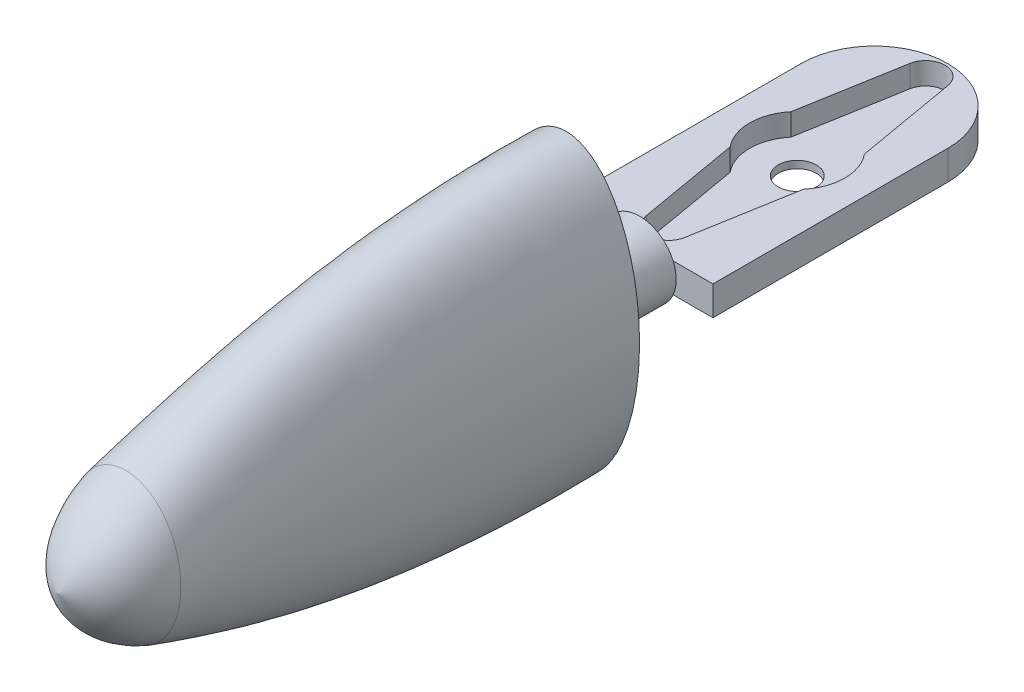
ISO-10303-21;
HEADER;
FILE_DESCRIPTION(('STEP AP214'),'2;1');
FILE_NAME('part.step','',(''),(''),'','','');
FILE_SCHEMA(('AUTOMOTIVE_DESIGN { 1 0 10303 214 1 1 1 1 }'));
ENDSEC;
DATA;
#1=APPLICATION_CONTEXT('core data for automotive mechanical design processes');
#2=APPLICATION_PROTOCOL_DEFINITION('international standard','automotive_design',2000,#1);
#3=PRODUCT_CONTEXT('',#1,'mechanical');
#4=PRODUCT('Part','Part','',(#3));
#5=PRODUCT_RELATED_PRODUCT_CATEGORY('part','',(#4));
#6=PRODUCT_DEFINITION_FORMATION('','',#4);
#7=PRODUCT_DEFINITION_CONTEXT('part definition',#1,'design');
#8=PRODUCT_DEFINITION('design','',#6,#7);
#9=PRODUCT_DEFINITION_SHAPE('','',#8);
#10=(LENGTH_UNIT() NAMED_UNIT(*) SI_UNIT(.MILLI.,.METRE.));
#11=(NAMED_UNIT(*) PLANE_ANGLE_UNIT() SI_UNIT($,.RADIAN.));
#12=(NAMED_UNIT(*) SI_UNIT($,.STERADIAN.) SOLID_ANGLE_UNIT());
#13=UNCERTAINTY_MEASURE_WITH_UNIT(LENGTH_MEASURE(1.E-05),#10,'distance_accuracy_value','');
#14=(GEOMETRIC_REPRESENTATION_CONTEXT(3) GLOBAL_UNCERTAINTY_ASSIGNED_CONTEXT((#13)) GLOBAL_UNIT_ASSIGNED_CONTEXT((#10,
#11,#12)) REPRESENTATION_CONTEXT('',''));
#15=CARTESIAN_POINT('',(0.,0.,0.));
#16=DIRECTION('',(0.,0.,1.));
#17=DIRECTION('',(1.,0.,0.));
#18=AXIS2_PLACEMENT_3D('',#15,#16,#17);
#19=CARTESIAN_POINT('',(0.,0.,-10.));
#20=DIRECTION('',(0.,0.,1.));
#21=DIRECTION('',(1.,0.,0.));
#22=AXIS2_PLACEMENT_3D('',#19,#20,#21);
#23=PLANE('',#22);
#24=DIRECTION('',(1.,0.,0.));
#25=VECTOR('',#24,1.);
#26=CARTESIAN_POINT('',(-10.,2.,-10.));
#27=LINE('',#26,#25);
#28=CARTESIAN_POINT('',(-4.58257569495584,2.,-10.));
#29=VERTEX_POINT('',#28);
#30=CARTESIAN_POINT('',(4.58257569495584,2.,-10.));
#31=VERTEX_POINT('',#30);
#32=EDGE_CURVE('E13',#29,#31,#27,.T.);
#33=ORIENTED_EDGE('',*,*,#32,.F.);
#34=CARTESIAN_POINT('',(0.,0.,-10.));
#35=DIRECTION('',(0.,0.,1.));
#36=DIRECTION('',(1.,0.,0.));
#37=AXIS2_PLACEMENT_3D('',#34,#35,#36);
#38=CIRCLE('',#37,5.);
#39=EDGE_CURVE('E477',#31,#29,#38,.T.);
#40=ORIENTED_EDGE('',*,*,#39,.F.);
#41=EDGE_LOOP('',(#33,#40));
#42=FACE_BOUND('',#41,.T.);
#43=ADVANCED_FACE('F262',(#42),#23,.F.);
#44=CARTESIAN_POINT('',(0.,0.,0.));
#45=DIRECTION('',(0.,0.,1.));
#46=DIRECTION('',(1.,0.,0.));
#47=AXIS2_PLACEMENT_3D('',#44,#45,#46);
#48=PLANE('',#47);
#49=CARTESIAN_POINT('',(0.,0.,0.));
#50=DIRECTION('',(0.,0.,1.));
#51=DIRECTION('',(1.,0.,0.));
#52=AXIS2_PLACEMENT_3D('',#49,#50,#51);
#53=CIRCLE('',#52,5.);
#54=CARTESIAN_POINT('',(5.,0.,0.));
#55=VERTEX_POINT('',#54);
#56=EDGE_CURVE('E269',#55,#55,#53,.T.);
#57=ORIENTED_EDGE('',*,*,#56,.T.);
#58=EDGE_LOOP('',(#57));
#59=FACE_BOUND('',#58,.T.);
#60=CARTESIAN_POINT('',(0.,0.,0.));
#61=DIRECTION('',(0.,0.,1.));
#62=DIRECTION('',(0.,1.,0.));
#63=AXIS2_PLACEMENT_3D('',#60,#61,#62);
#64=ELLIPSE('',#63,20.,10.);
#65=CARTESIAN_POINT('',(0.,20.,0.));
#66=VERTEX_POINT('',#65);
#67=EDGE_CURVE('E521',#66,#66,#64,.T.);
#68=ORIENTED_EDGE('',*,*,#67,.F.);
#69=EDGE_LOOP('',(#68));
#70=FACE_BOUND('',#69,.T.);
#71=ADVANCED_FACE('F505',(#59,#70),#48,.F.);
#72=CARTESIAN_POINT('',(0.,20.,0.));
#73=CARTESIAN_POINT('',(0.,20.9628748140619,20.7365674719028));
#74=CARTESIAN_POINT('',(0.,17.6295414807285,40.7365674719028));
#75=CARTESIAN_POINT('',(0.,10.,60.));
#76=CARTESIAN_POINT('',(-0.504606679227005,20.,0.));
#77=CARTESIAN_POINT('',(-0.432339748701736,20.9628748140619,20.7365674719028));
#78=CARTESIAN_POINT('',(-0.360072818176467,17.6295414807285,40.7365674719028));
#79=CARTESIAN_POINT('',(-0.287805887651198,10.,60.));
#80=CARTESIAN_POINT('',(-1.51211904377364,19.8450877064211,0.));
#81=CARTESIAN_POINT('',(-1.29583545278006,20.8278466898814,20.7365685548776));
#82=CARTESIAN_POINT('',(-1.07955186178649,17.531169399717,40.7365685546572));
#83=CARTESIAN_POINT('',(-0.86326827079291,9.95508353640808,60.));
#84=CARTESIAN_POINT('',(-3.36263948367983,18.9889580661463,0.));
#85=CARTESIAN_POINT('',(-2.90451014233172,20.0738398375189,20.7365747819824));
#86=CARTESIAN_POINT('',(-2.44638080098361,16.9757236094466,40.7365747804952));
#87=CARTESIAN_POINT('',(-1.9882514596355,9.69479636017136,60.));
#88=CARTESIAN_POINT('',(-5.22983208209301,17.2419801562347,0.));
#89=CARTESIAN_POINT('',(-4.58599471189225,18.469218030265,20.7365896728852));
#90=CARTESIAN_POINT('',(-3.9421573416915,15.7440711691936,40.7365896683686));
#91=CARTESIAN_POINT('',(-3.29831997149075,9.06710743286652,60.));
#92=CARTESIAN_POINT('',(-6.87803539166683,14.6892476927781,0.));
#93=CARTESIAN_POINT('',(-6.129196416073,15.9679155311144,20.7366172887413));
#94=CARTESIAN_POINT('',(-5.38035744047917,13.7218814154945,40.7366172786067));
#95=CARTESIAN_POINT('',(-4.63151846488533,7.95241956801191,60.0000000000001));
#96=CARTESIAN_POINT('',(-8.09791435234904,11.90933926868,0.));
#97=CARTESIAN_POINT('',(-7.29961037705591,13.1060359157074,20.736653026908));
#98=CARTESIAN_POINT('',(-6.50130640176279,11.3315024432022,40.7366530095028));
#99=CARTESIAN_POINT('',(-5.70300242646966,6.58792718910769,59.9999999999999));
#100=CARTESIAN_POINT('',(-8.97784471190876,9.00882481720827,0.));
#101=CARTESIAN_POINT('',(-8.15788934674504,10.0083980990816,20.7366952629234));
#102=CARTESIAN_POINT('',(-7.33793398158133,8.6908443384683,40.7366952369258));
#103=CARTESIAN_POINT('',(-6.51797861641761,5.05943219204327,60.0000000000001));
#104=CARTESIAN_POINT('',(-9.57634173999302,6.03754847208418,0.));
#105=CARTESIAN_POINT('',(-8.74689809764436,6.75239167506185,20.736742372325));
#106=CARTESIAN_POINT('',(-7.9174544552957,5.87968434456575,40.7367423367435));
#107=CARTESIAN_POINT('',(-7.08801081294704,3.42390010816371,60.));
#108=CARTESIAN_POINT('',(-9.92378968821849,3.02768347198876,0.));
#109=CARTESIAN_POINT('',(-9.09116418417545,3.39993803388239,20.7367927306508));
#110=CARTESIAN_POINT('',(-8.25853868013241,2.96453419262637,40.7367926848246));
#111=CARTESIAN_POINT('',(-7.42591317608937,1.72723364812232,59.9999999999999));
#112=CARTESIAN_POINT('',(-10.0381170539815,0.,0.));
#113=CARTESIAN_POINT('',(-9.20435533575895,0.00024468785131507,20.7368447134389));
#114=CARTESIAN_POINT('',(-8.37059361753635,-0.00211908646730605,40.7368446570373));
#115=CARTESIAN_POINT('',(-7.53683189931375,0.,59.9999999999999));
#116=CARTESIAN_POINT('',(-9.9237896882185,-3.02768347198876,0.));
#117=CARTESIAN_POINT('',(-9.09116418417546,-3.39944865817978,20.7368966962269));
#118=CARTESIAN_POINT('',(-8.25853868013242,-2.96877236556099,40.7368966292501));
#119=CARTESIAN_POINT('',(-7.42591317608937,-1.72723364812231,60.));
#120=CARTESIAN_POINT('',(-9.57634173999301,-6.03754847208416,0.));
#121=CARTESIAN_POINT('',(-8.74689809764436,-6.75190229935922,20.7369470545528));
#122=CARTESIAN_POINT('',(-7.9174544552957,-5.88392251750035,40.7369469773312));
#123=CARTESIAN_POINT('',(-7.08801081294705,-3.4239001081637,60.0000000000001));
#124=CARTESIAN_POINT('',(-8.97784471190877,-9.00882481720829,0.));
#125=CARTESIAN_POINT('',(-8.15788934674505,-10.007908723379,20.7369941639544));
#126=CARTESIAN_POINT('',(-7.33793398158132,-8.69508251140291,40.7369940771489));
#127=CARTESIAN_POINT('',(-6.5179786164176,-5.05943219204327,59.9999999999999));
#128=CARTESIAN_POINT('',(-8.09791435234902,-11.90933926868,0.));
#129=CARTESIAN_POINT('',(-7.2996103770559,-13.1055465400048,20.7370363999697));
#130=CARTESIAN_POINT('',(-6.50130640176279,-11.3357406161368,40.7370363045718));
#131=CARTESIAN_POINT('',(-5.70300242646968,-6.58792718910769,60.));
#132=CARTESIAN_POINT('',(-6.87803539166684,-14.6892476927781,0.));
#133=CARTESIAN_POINT('',(-6.129196416073,-15.9674261554118,20.7370721381364));
#134=CARTESIAN_POINT('',(-5.38035744047916,-13.7261195884291,40.737072035468));
#135=CARTESIAN_POINT('',(-4.63151846488532,-7.95241956801191,59.9999999999999));
#136=CARTESIAN_POINT('',(-5.229832082093,-17.2419801562347,0.));
#137=CARTESIAN_POINT('',(-4.58599471189225,-18.4687286545624,20.7370997539926));
#138=CARTESIAN_POINT('',(-3.94215734169151,-15.7483093421282,40.7370996457061));
#139=CARTESIAN_POINT('',(-3.29831997149077,-9.0671074328665,60.0000000000001));
#140=CARTESIAN_POINT('',(-3.36263948367983,-18.9889580661462,0.));
#141=CARTESIAN_POINT('',(-2.90451014233172,-20.0733504618162,20.7371146448954));
#142=CARTESIAN_POINT('',(-2.44638080098361,-16.9799617823811,40.7371145335795));
#143=CARTESIAN_POINT('',(-1.9882514596355,-9.69479636017136,60.));
#144=CARTESIAN_POINT('',(-1.51211904377365,-19.8450877064211,0.));
#145=CARTESIAN_POINT('',(-1.29583545278007,-20.8273573141788,20.7371208720002));
#146=CARTESIAN_POINT('',(-1.07955186178649,-17.5354075726516,40.7371207594175));
#147=CARTESIAN_POINT('',(-0.86326827079291,-9.95508353640808,60.));
#148=CARTESIAN_POINT('',(-0.504606679227006,-20.,0.));
#149=CARTESIAN_POINT('',(-0.432339748701736,-20.9623854383592,20.737121954975));
#150=CARTESIAN_POINT('',(-0.360072818176467,-17.6337796536631,40.7371218421719));
#151=CARTESIAN_POINT('',(-0.287805887651199,-10.,60.));
#152=CARTESIAN_POINT('',(0.504606679227004,-20.,0.));
#153=CARTESIAN_POINT('',(0.432339748701736,-20.9623854383592,20.737121954975));
#154=CARTESIAN_POINT('',(0.360072818176467,-17.6337796536631,40.7371218421719));
#155=CARTESIAN_POINT('',(0.287805887651198,-10.,60.));
#156=CARTESIAN_POINT('',(1.51211904377363,-19.845087706421,0.));
#157=CARTESIAN_POINT('',(1.29583545278006,-20.8273573141788,20.7371208720002));
#158=CARTESIAN_POINT('',(1.07955186178648,-17.5354075726516,40.7371207594175));
#159=CARTESIAN_POINT('',(0.863268270792907,-9.95508353640808,60.));
#160=CARTESIAN_POINT('',(3.36263948367984,-18.9889580661463,0.));
#161=CARTESIAN_POINT('',(2.90451014233173,-20.0733504618163,20.7371146448954));
#162=CARTESIAN_POINT('',(2.44638080098361,-16.9799617823812,40.7371145335795));
#163=CARTESIAN_POINT('',(1.98825145963549,-9.69479636017136,60.));
#164=CARTESIAN_POINT('',(5.22983208209299,-17.2419801562346,0.));
#165=CARTESIAN_POINT('',(4.58599471189224,-18.4687286545624,20.7370997539926));
#166=CARTESIAN_POINT('',(3.94215734169149,-15.7483093421282,40.7370996457061));
#167=CARTESIAN_POINT('',(3.29831997149075,-9.06710743286651,60.0000000000001));
#168=CARTESIAN_POINT('',(6.87803539166685,-14.6892476927781,0.));
#169=CARTESIAN_POINT('',(6.12919641607301,-15.9674261554118,20.7370721381365));
#170=CARTESIAN_POINT('',(5.38035744047917,-13.7261195884291,40.7370720354681));
#171=CARTESIAN_POINT('',(4.63151846488532,-7.95241956801192,60.));
#172=CARTESIAN_POINT('',(8.097914352349,-11.9093392686799,0.));
#173=CARTESIAN_POINT('',(7.29961037705589,-13.1055465400048,20.7370363999697));
#174=CARTESIAN_POINT('',(6.50130640176278,-11.3357406161368,40.7370363045718));
#175=CARTESIAN_POINT('',(5.70300242646967,-6.58792718910769,60.));
#176=CARTESIAN_POINT('',(8.97784471190879,-9.00882481720831,0.));
#177=CARTESIAN_POINT('',(8.15788934674506,-10.007908723379,20.7369941639545));
#178=CARTESIAN_POINT('',(7.33793398158133,-8.6950825114029,40.736994077149));
#179=CARTESIAN_POINT('',(6.5179786164176,-5.05943219204327,60.0000000000001));
#180=CARTESIAN_POINT('',(9.57634173999297,-6.03754847208416,0.));
#181=CARTESIAN_POINT('',(8.74689809764433,-6.75190229935923,20.7369470545528));
#182=CARTESIAN_POINT('',(7.91745445529568,-5.88392251750034,40.7369469773311));
#183=CARTESIAN_POINT('',(7.08801081294704,-3.42390010816371,59.9999999999999));
#184=CARTESIAN_POINT('',(9.92378968821853,-3.02768347198879,0.));
#185=CARTESIAN_POINT('',(9.09116418417547,-3.39944865817981,20.7368966962269));
#186=CARTESIAN_POINT('',(8.25853868013242,-2.96877236556098,40.7368966292501));
#187=CARTESIAN_POINT('',(7.42591317608936,-1.72723364812232,60.));
#188=CARTESIAN_POINT('',(10.0381170539815,0.,0.));
#189=CARTESIAN_POINT('',(9.20435533575893,0.000244687851300687,20.7368447134389));
#190=CARTESIAN_POINT('',(8.37059361753634,-0.00211908646729286,40.7368446570374));
#191=CARTESIAN_POINT('',(7.53683189931376,0.,60.0000000000001));
#192=CARTESIAN_POINT('',(9.92378968821852,3.02768347198875,0.));
#193=CARTESIAN_POINT('',(9.09116418417547,3.39993803388239,20.7367927306509));
#194=CARTESIAN_POINT('',(8.25853868013242,2.96453419262639,40.7367926848246));
#195=CARTESIAN_POINT('',(7.42591317608937,1.72723364812231,60.));
#196=CARTESIAN_POINT('',(9.57634173999299,6.03754847208416,0.));
#197=CARTESIAN_POINT('',(8.74689809764434,6.75239167506184,20.7367423723249));
#198=CARTESIAN_POINT('',(7.91745445529569,5.87968434456575,40.7367423367435));
#199=CARTESIAN_POINT('',(7.08801081294704,3.42390010816371,59.9999999999999));
#200=CARTESIAN_POINT('',(8.97784471190878,9.00882481720828,0.));
#201=CARTESIAN_POINT('',(8.15788934674505,10.0083980990816,20.7366952629234));
#202=CARTESIAN_POINT('',(7.33793398158133,8.6908443384683,40.7366952369258));
#203=CARTESIAN_POINT('',(6.51797861641761,5.05943219204325,60.0000000000001));
#204=CARTESIAN_POINT('',(8.09791435234902,11.90933926868,0.));
#205=CARTESIAN_POINT('',(7.29961037705591,13.1060359157075,20.736653026908));
#206=CARTESIAN_POINT('',(6.50130640176279,11.3315024432022,40.7366530095029));
#207=CARTESIAN_POINT('',(5.70300242646967,6.5879271891077,59.9999999999999));
#208=CARTESIAN_POINT('',(6.87803539166684,14.689247692778,0.));
#209=CARTESIAN_POINT('',(6.129196416073,15.9679155311144,20.7366172887413));
#210=CARTESIAN_POINT('',(5.38035744047917,13.7218814154945,40.7366172786066));
#211=CARTESIAN_POINT('',(4.63151846488533,7.95241956801187,60.));
#212=CARTESIAN_POINT('',(5.22983208209301,17.2419801562347,0.));
#213=CARTESIAN_POINT('',(4.58599471189226,18.4692180302651,20.7365896728852));
#214=CARTESIAN_POINT('',(3.94215734169151,15.7440711691936,40.7365896683687));
#215=CARTESIAN_POINT('',(3.29831997149076,9.06710743286654,60.));
#216=CARTESIAN_POINT('',(3.36263948367981,18.9889580661462,0.));
#217=CARTESIAN_POINT('',(2.90451014233171,20.0738398375189,20.7365747819824));
#218=CARTESIAN_POINT('',(2.44638080098361,16.9757236094466,40.7365747804952));
#219=CARTESIAN_POINT('',(1.98825145963551,9.69479636017135,60.));
#220=CARTESIAN_POINT('',(1.51211904377363,19.8450877064211,0.));
#221=CARTESIAN_POINT('',(1.29583545278006,20.8278466898814,20.7365685548775));
#222=CARTESIAN_POINT('',(1.07955186178648,17.531169399717,40.7365685546572));
#223=CARTESIAN_POINT('',(0.863268270792912,9.95508353640808,60.));
#224=CARTESIAN_POINT('',(0.504606679227005,20.,0.));
#225=CARTESIAN_POINT('',(0.432339748701736,20.9628748140619,20.7365674719028));
#226=CARTESIAN_POINT('',(0.360072818176467,17.6295414807285,40.7365674719028));
#227=CARTESIAN_POINT('',(0.287805887651198,10.,60.));
#228=CARTESIAN_POINT('',(0.,20.,0.));
#229=CARTESIAN_POINT('',(0.,20.9628748140619,20.7365674719028));
#230=CARTESIAN_POINT('',(0.,17.6295414807285,40.7365674719028));
#231=CARTESIAN_POINT('',(0.,10.,60.));
#232=B_SPLINE_SURFACE_WITH_KNOTS('',3,3,((#72,#73,#74,#75),(#76,#77,#78,#79),(#80,#81,#82,#83),
(#84,#85,#86,#87),(#88,#89,#90,#91),(#92,#93,#94,#95),(#96,#97,#98,#99),(#100,#101,#102,#103),
(#104,#105,#106,#107),(#108,#109,#110,#111),(#112,#113,#114,#115),(#116,#117,#118,#119),(#120,
#121,#122,#123),(#124,#125,#126,#127),(#128,#129,#130,#131),(#132,#133,#134,#135),(#136,#137,
#138,#139),(#140,#141,#142,#143),(#144,#145,#146,#147),(#148,#149,#150,#151),(#152,#153,#154,
#155),(#156,#157,#158,#159),(#160,#161,#162,#163),(#164,#165,#166,#167),(#168,#169,#170,#171),
(#172,#173,#174,#175),(#176,#177,#178,#179),(#180,#181,#182,#183),(#184,#185,#186,#187),(#188,
#189,#190,#191),(#192,#193,#194,#195),(#196,#197,#198,#199),(#200,#201,#202,#203),(#204,#205,
#206,#207),(#208,#209,#210,#211),(#212,#213,#214,#215),(#216,#217,#218,#219),(#220,#221,#222,
#223),(#224,#225,#226,#227),(#228,#229,#230,#231)),.UNSPECIFIED.,.T.,.F.,.F.,(4,1,1,1,1,1,1,1,1,
1,1,1,1,1,1,1,1,1,2,1,1,1,1,1,1,1,1,1,1,1,1,1,1,1,1,1,4),(4,4),(0.,0.015625,0.03125,0.0625,
0.09375,0.125,0.15625,0.1875,0.21875,0.25,0.28125,0.3125,0.34375,0.375,0.40625,0.4375,0.46875,
0.484375,0.5,0.515625,0.53125,0.5625,0.59375,0.625,0.65625,0.6875,0.71875,0.75,0.78125,0.8125,
0.84375,0.875,0.90625,0.9375,0.96875,0.984375,1.),(0.,1.),.UNSPECIFIED.);
#233=CARTESIAN_POINT('',(0.,0.,60.));
#234=DIRECTION('',(0.,0.,1.));
#235=DIRECTION('',(0.,1.,0.));
#236=AXIS2_PLACEMENT_3D('',#233,#234,#235);
#237=ELLIPSE('',#236,10.,7.5);
#238=CARTESIAN_POINT('',(0.,10.,60.));
#239=VERTEX_POINT('',#238);
#240=EDGE_CURVE('E485',#239,#239,#237,.T.);
#241=ORIENTED_EDGE('',*,*,#67,.T.);
#242=EDGE_LOOP('',(#241));
#243=FACE_BOUND('',#242,.T.);
#244=ORIENTED_EDGE('',*,*,#240,.F.);
#245=EDGE_LOOP('',(#244));
#246=FACE_BOUND('',#245,.T.);
#247=ADVANCED_FACE('F264',(#243,#246),#232,.T.);
#248=CARTESIAN_POINT('',(0.,10.0000152590616,59.9999614731579));
#249=CARTESIAN_POINT('',(-0.287803424048341,10.0000152590621,59.9999614731579));
#250=CARTESIAN_POINT('',(-0.863410087878709,9.95583806079738,59.9999616989012));
#251=CARTESIAN_POINT('',(-1.70677312786941,9.75940519727775,59.9999626442014));
#252=CARTESIAN_POINT('',(-2.5125052540897,9.44384043728572,59.9999641256418));
#253=CARTESIAN_POINT('',(-3.52032980804554,8.88137952784575,59.9999667216897));
#254=CARTESIAN_POINT('',(-4.63153206478585,7.95229875926061,59.9999709543765));
#255=CARTESIAN_POINT('',(-5.70299471729741,6.58813345922687,59.9999770494447));
#256=CARTESIAN_POINT('',(-6.51776252975134,5.05911322216334,59.999983595999));
#257=CARTESIAN_POINT('',(-7.08825990947597,3.42436248739937,59.9999900296803));
#258=CARTESIAN_POINT('',(-7.42538142170511,1.72683829704838,59.9999957861308));
#259=CARTESIAN_POINT('',(-7.53720343131966,1.77942804894839E-06,60.0000003009872));
#260=CARTESIAN_POINT('',(-7.42538182773256,-1.72683444277763,60.0000030098973));
#261=CARTESIAN_POINT('',(-7.08826154695672,-3.42435351790571,60.0000042514798));
#262=CARTESIAN_POINT('',(-6.51776543721104,-5.05910195659626,60.000004364351));
#263=CARTESIAN_POINT('',(-5.70299866760887,-6.58811961293905,60.000003687124));
#264=CARTESIAN_POINT('',(-4.63153646261046,-7.95228393543587,60.0000025584126));
#265=CARTESIAN_POINT('',(-3.52033371559342,-8.8813642154407,60.0000015237605));
#266=CARTESIAN_POINT('',(-2.51250847558941,-9.4438251370515,60.0000008089098));
#267=CARTESIAN_POINT('',(-1.70677513471405,-9.75938991922258,60.0000003715341));
#268=CARTESIAN_POINT('',(-0.863411631977673,-9.95582280064711,60.0000000752474));
#269=CARTESIAN_POINT('',(9.21327419500936E-08,-10.0220885996758,59.9999999623763));
#270=CARTESIAN_POINT('',(0.863411263446692,-9.95582280064988,60.0000000752475));
#271=CARTESIAN_POINT('',(1.70677537055961,-9.75938990592728,60.0000003715342));
#272=CARTESIAN_POINT('',(2.51250837067826,-9.44382512413137,60.0000008089099));
#273=CARTESIAN_POINT('',(3.52033377111656,-8.88136425973224,60.0000015237605));
#274=CARTESIAN_POINT('',(4.6315364367399,-7.95228384295369,60.0000025584126));
#275=CARTESIAN_POINT('',(5.70299867190342,-6.58811976750625,60.0000036871241));
#276=CARTESIAN_POINT('',(6.5177654515679,-5.05910167722607,60.000004364351));
#277=CARTESIAN_POINT('',(7.08826150963172,-3.42435401414788,60.0000042514799));
#278=CARTESIAN_POINT('',(7.42538182773985,-1.72683370569057,60.0000030098973));
#279=CARTESIAN_POINT('',(7.53720343131984,1.41092674045898E-06,60.0000003009873));
#280=CARTESIAN_POINT('',(7.42538142169712,1.72683903414345,59.9999957861308));
#281=CARTESIAN_POINT('',(7.08825994680124,3.4243619911558,59.9999900296804));
#282=CARTESIAN_POINT('',(6.51776251539432,5.05911350153438,59.9999835959991));
#283=CARTESIAN_POINT('',(5.70299471300302,6.5881333046591,59.9999770494446));
#284=CARTESIAN_POINT('',(4.63153209065633,7.95229885174312,59.9999709543766));
#285=CARTESIAN_POINT('',(3.52032975252255,8.88137948355395,59.9999667216896));
#286=CARTESIAN_POINT('',(2.51250535900069,9.44384045020598,59.9999641256419));
#287=CARTESIAN_POINT('',(1.70677289202421,9.75940521057294,59.9999626442013));
#288=CARTESIAN_POINT('',(0.863410456411341,9.95583806079459,59.9999616989013));
#289=CARTESIAN_POINT('',(0.28780342404834,10.0000152590612,59.9999614731579));
#290=CARTESIAN_POINT('',(0.,10.0000152590616,59.9999614731579));
#291=CARTESIAN_POINT('',(0.,8.00461265679434,64.8798268998124));
#292=CARTESIAN_POINT('',(-0.239844495986041,8.00461265679463,64.8798268998124));
#293=CARTESIAN_POINT('',(-0.719533399249717,7.97010534170234,64.8789348724661));
#294=CARTESIAN_POINT('',(-1.42502114744341,7.81754404755485,64.8752552632517));
#295=CARTESIAN_POINT('',(-2.10397749682092,7.57239546161922,64.8695685996863));
#296=CARTESIAN_POINT('',(-2.96174846628874,7.13456501050219,64.8597563275896));
#297=CARTESIAN_POINT('',(-3.92636985841736,6.40741839779871,64.844145920811));
#298=CARTESIAN_POINT('',(-4.88561231412082,5.3280095503153,64.8227374367754));
#299=CARTESIAN_POINT('',(-5.639104575166,4.10502234791035,64.8013290675904));
#300=CARTESIAN_POINT('',(-6.18392114989125,2.78569498036572,64.782596924007));
#301=CARTESIAN_POINT('',(-6.51616764664176,1.40702628589317,64.7692171167772));
#302=CARTESIAN_POINT('',(-6.63016477434849,1.30840135144877E-06,64.7638657615095));
#303=CARTESIAN_POINT('',(-6.51616725434082,-1.40702257953857,64.7692189349483));
#304=CARTESIAN_POINT('',(-6.1839213359567,-2.7856856626788,64.7826004494841));
#305=CARTESIAN_POINT('',(-5.63910563273601,-4.10500863966178,64.8013341563742));
#306=CARTESIAN_POINT('',(-4.88561426730983,-5.32799104221447,64.8227439020161));
#307=CARTESIAN_POINT('',(-3.92637239736226,-6.40739621185812,64.8441535328079));
#308=CARTESIAN_POINT('',(-2.9617509186739,-7.13454033479935,64.859764668091));
#309=CARTESIAN_POINT('',(-2.10397962668336,-7.57236943837021,64.8695773652904));
#310=CARTESIAN_POINT('',(-1.42502254581573,-7.81751725837538,64.8752642634761));
#311=CARTESIAN_POINT('',(-0.719534483554649,-7.97007806230867,64.8789440177478));
#312=CARTESIAN_POINT('',(5.8350736122153E-08,-8.02183885480926,64.880282108905));
#313=CARTESIAN_POINT('',(0.719534250151694,-7.97007806231043,64.8789440177478));
#314=CARTESIAN_POINT('',(1.42502269518459,-7.81751724995503,64.8752642634761));
#315=CARTESIAN_POINT('',(2.10397956023962,-7.57236943018745,64.8695773652904));
#316=CARTESIAN_POINT('',(2.96175095383855,-7.13454036285065,64.8597646680911));
#317=CARTESIAN_POINT('',(3.92637238097756,-6.40739615328607,64.8441535328079));
#318=CARTESIAN_POINT('',(4.8856142700297,-5.32799114010703,64.8227439020161));
#319=CARTESIAN_POINT('',(5.63910564182867,-4.10500846272732,64.8013341563742));
#320=CARTESIAN_POINT('',(6.1839213123175,-2.7856859769655,64.7826004494842));
#321=CARTESIAN_POINT('',(6.5161672543454,-1.40702211271676,64.7692189349483));
#322=CARTESIAN_POINT('',(6.63016477434856,1.07501718941624E-06,64.7638657615095));
#323=CARTESIAN_POINT('',(6.51616764663667,1.40702675272005,64.7692171167772));
#324=CARTESIAN_POINT('',(6.18392117353056,2.78569466607812,64.782596924007));
#325=CARTESIAN_POINT('',(5.63910456607319,4.10502252484534,64.8013290675904));
#326=CARTESIAN_POINT('',(4.88561231140102,5.32800945242238,64.8227374367753));
#327=CARTESIAN_POINT('',(3.92636987480198,6.40741845637097,64.844145920811));
#328=CARTESIAN_POINT('',(2.96174843112418,7.13456498245072,64.8597563275895));
#329=CARTESIAN_POINT('',(2.10397756326454,7.57239546980205,64.8695685996864));
#330=CARTESIAN_POINT('',(1.42502099807479,7.81754405597513,64.8752552632517));
#331=CARTESIAN_POINT('',(0.719533576666528,7.97010534170057,64.8789348724661));
#332=CARTESIAN_POINT('',(0.23984449598604,8.00461265679405,64.8798268998124));
#333=CARTESIAN_POINT('',(0.,8.00461265679434,64.8798268998124));
#334=CARTESIAN_POINT('',(0.,4.67127321983636,67.9491032710654));
#335=CARTESIAN_POINT('',(-0.147472231280877,4.67127321983653,67.9491032710654));
#336=CARTESIAN_POINT('',(-0.442416646674226,4.65115066599031,67.9482111534218));
#337=CARTESIAN_POINT('',(-0.876499701967563,4.56220197349015,67.9445311660874));
#338=CARTESIAN_POINT('',(-1.29481865965088,4.41927045409244,67.9388439099457));
#339=CARTESIAN_POINT('',(-1.82426722316895,4.16398176556881,67.9290305994299));
#340=CARTESIAN_POINT('',(-2.42176853536788,3.73992874092336,67.9134184995766));
#341=CARTESIAN_POINT('',(-3.01911711606277,3.11023507546829,67.8920075775136));
#342=CARTESIAN_POINT('',(-3.49088598684313,2.39654941674917,67.8705965897069));
#343=CARTESIAN_POINT('',(-3.8337661354016,1.62643717354596,67.8518618726511));
#344=CARTESIAN_POINT('',(-4.04388760732951,0.821535708992759,67.8384797628411));
#345=CARTESIAN_POINT('',(-4.11634707953471,7.22138445247417E-07,67.8331266016308));
#346=CARTESIAN_POINT('',(-4.04388728302095,-0.821533377675594,67.8384786915056));
#347=CARTESIAN_POINT('',(-3.83376611577527,-1.62643095038539,67.8518597094084));
#348=CARTESIAN_POINT('',(-3.49088648182588,-2.39653975974214,67.8705933711499));
#349=CARTESIAN_POINT('',(-3.01911816475015,-3.11022162445594,67.8920033876826));
#350=CARTESIAN_POINT('',(-2.42176996841928,-3.73991214785461,67.9134134699591));
#351=CARTESIAN_POINT('',(-1.82426863961957,-4.16396299368034,67.929025019103));
#352=CARTESIAN_POINT('',(-1.2948199061342,-4.41925043888818,67.9388380022426));
#353=CARTESIAN_POINT('',(-0.876500530611882,-4.56218124655249,67.9445250753786));
#354=CARTESIAN_POINT('',(-0.442417290348249,-4.65112948170805,67.9482049481649));
#355=CARTESIAN_POINT('',(3.37820050750976E-08,-4.68131314510974,67.9495430844707));
#356=CARTESIAN_POINT('',(0.442417155220223,-4.65112948170906,67.9482049481649));
#357=CARTESIAN_POINT('',(0.876500617088586,-4.56218124167755,67.9445250753786));
#358=CARTESIAN_POINT('',(1.29481986766677,-4.4192504341508,67.9388380022426));
#359=CARTESIAN_POINT('',(1.82426865997805,-4.16396300992057,67.929025019103));
#360=CARTESIAN_POINT('',(2.4217699589334,-3.73991211394448,67.9134134699591));
#361=CARTESIAN_POINT('',(3.0191181663248,-3.11022168113057,67.8920033876826));
#362=CARTESIAN_POINT('',(3.49088648709004,-2.3965396573064,67.8705933711499));
#363=CARTESIAN_POINT('',(3.8337661020894,-1.62643113234086,67.8518597094084));
#364=CARTESIAN_POINT('',(4.04388728302358,-0.821533107410339,67.8384786915056));
#365=CARTESIAN_POINT('',(4.11634707953474,5.87021298974547E-07,67.8331266016308));
#366=CARTESIAN_POINT('',(4.04388760732655,0.821535979260951,67.8384797628411));
#367=CARTESIAN_POINT('',(3.83376614908751,1.62643699158998,67.851861872651));
#368=CARTESIAN_POINT('',(3.49088598157886,2.39654951918522,67.8705965897069));
#369=CARTESIAN_POINT('',(3.01911711448814,3.11023501879344,67.8920075775136));
#370=CARTESIAN_POINT('',(2.42176854485371,3.73992877483362,67.9134184995766));
#371=CARTESIAN_POINT('',(1.82426720281052,4.16398174932849,67.9290305994298));
#372=CARTESIAN_POINT('',(1.29481869811824,4.41927045882987,67.9388439099458));
#373=CARTESIAN_POINT('',(0.876499615490989,4.56220197836505,67.9445311660873));
#374=CARTESIAN_POINT('',(0.442416741011039,4.65115066598929,67.9482111534218));
#375=CARTESIAN_POINT('',(0.147472231280877,4.67127321983619,67.9491032710654));
#376=CARTESIAN_POINT('',(0.,4.67127321983636,67.9491032710654));
#377=CARTESIAN_POINT('',(0.,0.,69.2077828815485));
#378=CARTESIAN_POINT('',(0.,0.,69.2077828815485));
#379=CARTESIAN_POINT('',(0.,0.,69.2077828815485));
#380=CARTESIAN_POINT('',(0.,0.,69.2077828815485));
#381=CARTESIAN_POINT('',(0.,0.,69.2077828815485));
#382=CARTESIAN_POINT('',(0.,0.,69.2077828815485));
#383=CARTESIAN_POINT('',(0.,0.,69.2077828815485));
#384=CARTESIAN_POINT('',(0.,0.,69.2077828815485));
#385=CARTESIAN_POINT('',(0.,0.,69.2077828815485));
#386=CARTESIAN_POINT('',(0.,0.,69.2077828815485));
#387=CARTESIAN_POINT('',(0.,0.,69.2077828815485));
#388=CARTESIAN_POINT('',(0.,0.,69.2077828815485));
#389=CARTESIAN_POINT('',(0.,0.,69.2077828815485));
#390=CARTESIAN_POINT('',(0.,0.,69.2077828815485));
#391=CARTESIAN_POINT('',(0.,0.,69.2077828815485));
#392=CARTESIAN_POINT('',(0.,0.,69.2077828815485));
#393=CARTESIAN_POINT('',(0.,0.,69.2077828815485));
#394=CARTESIAN_POINT('',(0.,0.,69.2077828815485));
#395=CARTESIAN_POINT('',(0.,0.,69.2077828815485));
#396=CARTESIAN_POINT('',(0.,0.,69.2077828815485));
#397=CARTESIAN_POINT('',(0.,0.,69.2077828815485));
#398=CARTESIAN_POINT('',(0.,0.,69.2077828815485));
#399=CARTESIAN_POINT('',(0.,0.,69.2077828815485));
#400=CARTESIAN_POINT('',(0.,0.,69.2077828815485));
#401=CARTESIAN_POINT('',(0.,0.,69.2077828815485));
#402=CARTESIAN_POINT('',(0.,0.,69.2077828815485));
#403=CARTESIAN_POINT('',(0.,0.,69.2077828815485));
#404=CARTESIAN_POINT('',(0.,0.,69.2077828815485));
#405=CARTESIAN_POINT('',(0.,0.,69.2077828815485));
#406=CARTESIAN_POINT('',(0.,0.,69.2077828815485));
#407=CARTESIAN_POINT('',(0.,0.,69.2077828815485));
#408=CARTESIAN_POINT('',(0.,0.,69.2077828815485));
#409=CARTESIAN_POINT('',(0.,0.,69.2077828815485));
#410=CARTESIAN_POINT('',(0.,0.,69.2077828815485));
#411=CARTESIAN_POINT('',(0.,0.,69.2077828815485));
#412=CARTESIAN_POINT('',(0.,0.,69.2077828815485));
#413=CARTESIAN_POINT('',(0.,0.,69.2077828815485));
#414=CARTESIAN_POINT('',(0.,0.,69.2077828815485));
#415=CARTESIAN_POINT('',(0.,0.,69.2077828815485));
#416=CARTESIAN_POINT('',(0.,0.,69.2077828815485));
#417=CARTESIAN_POINT('',(0.,0.,69.2077828815485));
#418=CARTESIAN_POINT('',(0.,0.,69.2077828815485));
#419=CARTESIAN_POINT('',(0.,0.,69.2077828815485));
#420=B_SPLINE_SURFACE_WITH_KNOTS('',3,3,((#248,#249,#250,#251,#252,#253,#254,#255,#256,#257,
#258,#259,#260,#261,#262,#263,#264,#265,#266,#267,#268,#269,#270,#271,#272,#273,#274,#275,#276,
#277,#278,#279,#280,#281,#282,#283,#284,#285,#286,#287,#288,#289,#290),(#291,#292,#293,#294,
#295,#296,#297,#298,#299,#300,#301,#302,#303,#304,#305,#306,#307,#308,#309,#310,#311,#312,#313,
#314,#315,#316,#317,#318,#319,#320,#321,#322,#323,#324,#325,#326,#327,#328,#329,#330,#331,#332,
#333),(#334,#335,#336,#337,#338,#339,#340,#341,#342,#343,#344,#345,#346,#347,#348,#349,#350,
#351,#352,#353,#354,#355,#356,#357,#358,#359,#360,#361,#362,#363,#364,#365,#366,#367,#368,#369,
#370,#371,#372,#373,#374,#375,#376),(#377,#378,#379,#380,#381,#382,#383,#384,#385,#386,#387,
#388,#389,#390,#391,#392,#393,#394,#395,#396,#397,#398,#399,#400,#401,#402,#403,#404,#405,#406,
#407,#408,#409,#410,#411,#412,#413,#414,#415,#416,#417,#418,#419)),.UNSPECIFIED.,.F.,.T.,.F.,(4,
4),(4,1,1,1,1,1,1,1,1,1,1,1,1,1,1,1,1,1,1,1,1,1,1,1,1,1,1,1,1,1,1,1,1,1,1,1,1,1,1,1,4),(0.,1.),
(0.,0.0156250212739034,0.0312500425478067,0.0468750638217101,0.0625000850956135,
0.0937501276434202,0.125000170191227,0.156250212739034,0.18750025528684,0.218750297834647,
0.250000340382454,0.281250297834647,0.312500255286841,0.343750212739034,0.375000170191227,
0.40625012764342,0.437500085095614,0.453125063821711,0.468750042547807,0.484375021273904,
0.500000000000001,0.515624978726097,0.531249957452194,0.546874936178291,0.562499914904387,
0.59374987235658,0.624999829808774,0.656249787260967,0.68749974471316,0.718749702165354,
0.749999659617547,0.781249702165353,0.81249974471316,0.843749787260967,0.874999829808773,
0.90624987235658,0.937499914904387,0.95312493617829,0.968749957452193,0.984374978726097,1.),.UNSPECIFIED.);
#421=ORIENTED_EDGE('',*,*,#240,.T.);
#422=EDGE_LOOP('',(#421));
#423=FACE_BOUND('',#422,.T.);
#424=CARTESIAN_POINT('',(0.,0.,69.2077828815485));
#425=VERTEX_POINT('',#424);
#426=VERTEX_LOOP('',#425);
#427=FACE_BOUND('',#426,.T.);
#428=ADVANCED_FACE('F492',(#423,#427),#420,.F.);
#429=CARTESIAN_POINT('',(0.,0.,-10.));
#430=DIRECTION('',(0.,0.,1.));
#431=DIRECTION('',(1.,0.,0.));
#432=AXIS2_PLACEMENT_3D('',#429,#430,#431);
#433=CYLINDRICAL_SURFACE('',#432,5.);
#434=ORIENTED_EDGE('',*,*,#39,.T.);
#435=CARTESIAN_POINT('',(-4.58257569495584,-2.,-10.));
#436=VERTEX_POINT('',#435);
#437=EDGE_CURVE('E480',#29,#436,#38,.T.);
#438=ORIENTED_EDGE('',*,*,#437,.T.);
#439=CARTESIAN_POINT('',(4.58257569495584,-2.,-10.));
#440=VERTEX_POINT('',#439);
#441=EDGE_CURVE('E561',#436,#440,#38,.T.);
#442=ORIENTED_EDGE('',*,*,#441,.T.);
#443=EDGE_CURVE('E470',#440,#31,#38,.T.);
#444=ORIENTED_EDGE('',*,*,#443,.T.);
#445=EDGE_LOOP('',(#434,#438,#442,#444));
#446=FACE_BOUND('',#445,.T.);
#447=ORIENTED_EDGE('',*,*,#56,.F.);
#448=EDGE_LOOP('',(#447));
#449=FACE_BOUND('',#448,.T.);
#450=ADVANCED_FACE('F503',(#446,#449),#433,.T.);
#451=ORIENTED_EDGE('',*,*,#441,.F.);
#452=DIRECTION('',(1.,0.,0.));
#453=VECTOR('',#452,1.);
#454=CARTESIAN_POINT('',(-10.,-2.,-10.));
#455=LINE('',#454,#453);
#456=EDGE_CURVE('E274',#436,#440,#455,.T.);
#457=ORIENTED_EDGE('',*,*,#456,.T.);
#458=EDGE_LOOP('',(#451,#457));
#459=FACE_BOUND('',#458,.T.);
#460=ADVANCED_FACE('F563',(#459),#23,.F.);
#461=CARTESIAN_POINT('',(-10.,-2.,-10.));
#462=DIRECTION('',(0.,0.,1.));
#463=DIRECTION('',(1.,0.,0.));
#464=AXIS2_PLACEMENT_3D('',#461,#462,#463);
#465=PLANE('',#464);
#466=ORIENTED_EDGE('',*,*,#437,.F.);
#467=CARTESIAN_POINT('',(-10.,2.,-10.));
#468=VERTEX_POINT('',#467);
#469=EDGE_CURVE('E276',#468,#29,#27,.T.);
#470=ORIENTED_EDGE('',*,*,#469,.F.);
#471=DIRECTION('',(0.,1.,0.));
#472=VECTOR('',#471,1.);
#473=CARTESIAN_POINT('',(-10.,-2.,-10.));
#474=LINE('',#473,#472);
#475=CARTESIAN_POINT('',(-10.,-2.,-10.));
#476=VERTEX_POINT('',#475);
#477=EDGE_CURVE('E468',#476,#468,#474,.T.);
#478=ORIENTED_EDGE('',*,*,#477,.F.);
#479=EDGE_CURVE('E457',#476,#436,#455,.T.);
#480=ORIENTED_EDGE('',*,*,#479,.T.);
#481=EDGE_LOOP('',(#466,#470,#478,#480));
#482=FACE_BOUND('',#481,.T.);
#483=ADVANCED_FACE('F568',(#482),#465,.T.);
#484=ORIENTED_EDGE('',*,*,#443,.F.);
#485=CARTESIAN_POINT('',(10.,-2.,-10.));
#486=VERTEX_POINT('',#485);
#487=EDGE_CURVE('E292',#440,#486,#455,.T.);
#488=ORIENTED_EDGE('',*,*,#487,.T.);
#489=DIRECTION('',(0.,1.,0.));
#490=VECTOR('',#489,1.);
#491=CARTESIAN_POINT('',(10.,-2.,-10.));
#492=LINE('',#491,#490);
#493=CARTESIAN_POINT('',(10.,2.,-10.));
#494=VERTEX_POINT('',#493);
#495=EDGE_CURVE('E467',#486,#494,#492,.T.);
#496=ORIENTED_EDGE('',*,*,#495,.T.);
#497=EDGE_CURVE('E277',#31,#494,#27,.T.);
#498=ORIENTED_EDGE('',*,*,#497,.F.);
#499=EDGE_LOOP('',(#484,#488,#496,#498));
#500=FACE_BOUND('',#499,.T.);
#501=ADVANCED_FACE('F537',(#500),#465,.T.);
#502=CARTESIAN_POINT('',(-10.,-2.,-10.));
#503=DIRECTION('',(1.,0.,0.));
#504=DIRECTION('',(0.,0.,-1.));
#505=AXIS2_PLACEMENT_3D('',#502,#503,#504);
#506=PLANE('',#505);
#507=ORIENTED_EDGE('',*,*,#477,.T.);
#508=DIRECTION('',(0.,0.,-1.));
#509=VECTOR('',#508,1.);
#510=CARTESIAN_POINT('',(-10.,2.,-10.));
#511=LINE('',#510,#509);
#512=CARTESIAN_POINT('',(-10.,2.,-42.));
#513=VERTEX_POINT('',#512);
#514=EDGE_CURVE('E454',#468,#513,#511,.T.);
#515=ORIENTED_EDGE('',*,*,#514,.T.);
#516=DIRECTION('',(0.,1.,0.));
#517=VECTOR('',#516,1.);
#518=CARTESIAN_POINT('',(-10.,-2.,-42.));
#519=LINE('',#518,#517);
#520=CARTESIAN_POINT('',(-10.,-2.,-42.));
#521=VERTEX_POINT('',#520);
#522=EDGE_CURVE('E471',#521,#513,#519,.T.);
#523=ORIENTED_EDGE('',*,*,#522,.F.);
#524=DIRECTION('',(0.,0.,-1.));
#525=VECTOR('',#524,1.);
#526=CARTESIAN_POINT('',(-10.,-2.,-10.));
#527=LINE('',#526,#525);
#528=EDGE_CURVE('E465',#476,#521,#527,.T.);
#529=ORIENTED_EDGE('',*,*,#528,.F.);
#530=EDGE_LOOP('',(#507,#515,#523,#529));
#531=FACE_BOUND('',#530,.T.);
#532=ADVANCED_FACE('F575',(#531),#506,.F.);
#533=CARTESIAN_POINT('',(0.,-2.,-42.));
#534=DIRECTION('',(0.,1.,0.));
#535=DIRECTION('',(0.,0.,1.));
#536=AXIS2_PLACEMENT_3D('',#533,#534,#535);
#537=CYLINDRICAL_SURFACE('',#536,10.);
#538=ORIENTED_EDGE('',*,*,#522,.T.);
#539=CARTESIAN_POINT('',(0.,2.,-42.));
#540=DIRECTION('',(0.,-1.,0.));
#541=DIRECTION('',(0.,0.,-1.));
#542=AXIS2_PLACEMENT_3D('',#539,#540,#541);
#543=CIRCLE('',#542,10.);
#544=CARTESIAN_POINT('',(10.,2.,-42.));
#545=VERTEX_POINT('',#544);
#546=EDGE_CURVE('E451',#513,#545,#543,.T.);
#547=ORIENTED_EDGE('',*,*,#546,.T.);
#548=DIRECTION('',(0.,1.,0.));
#549=VECTOR('',#548,1.);
#550=CARTESIAN_POINT('',(10.,-2.,-42.));
#551=LINE('',#550,#549);
#552=CARTESIAN_POINT('',(10.,-2.,-42.));
#553=VERTEX_POINT('',#552);
#554=EDGE_CURVE('E473',#553,#545,#551,.T.);
#555=ORIENTED_EDGE('',*,*,#554,.F.);
#556=CARTESIAN_POINT('',(0.,-2.,-42.));
#557=DIRECTION('',(0.,-1.,0.));
#558=DIRECTION('',(0.,0.,-1.));
#559=AXIS2_PLACEMENT_3D('',#556,#557,#558);
#560=CIRCLE('',#559,10.);
#561=EDGE_CURVE('E463',#521,#553,#560,.T.);
#562=ORIENTED_EDGE('',*,*,#561,.F.);
#563=EDGE_LOOP('',(#538,#547,#555,#562));
#564=FACE_BOUND('',#563,.T.);
#565=ADVANCED_FACE('F549',(#564),#537,.T.);
#566=CARTESIAN_POINT('',(10.,-2.,-10.));
#567=DIRECTION('',(1.,0.,0.));
#568=DIRECTION('',(0.,0.,-1.));
#569=AXIS2_PLACEMENT_3D('',#566,#567,#568);
#570=PLANE('',#569);
#571=ORIENTED_EDGE('',*,*,#554,.T.);
#572=DIRECTION('',(0.,0.,-1.));
#573=VECTOR('',#572,1.);
#574=CARTESIAN_POINT('',(10.,2.,-10.));
#575=LINE('',#574,#573);
#576=EDGE_CURVE('E448',#494,#545,#575,.T.);
#577=ORIENTED_EDGE('',*,*,#576,.F.);
#578=ORIENTED_EDGE('',*,*,#495,.F.);
#579=DIRECTION('',(0.,0.,-1.));
#580=VECTOR('',#579,1.);
#581=CARTESIAN_POINT('',(10.,-2.,-10.));
#582=LINE('',#581,#580);
#583=EDGE_CURVE('E460',#486,#553,#582,.T.);
#584=ORIENTED_EDGE('',*,*,#583,.T.);
#585=EDGE_LOOP('',(#571,#577,#578,#584));
#586=FACE_BOUND('',#585,.T.);
#587=ADVANCED_FACE('F541',(#586),#570,.T.);
#588=CARTESIAN_POINT('',(0.,-2.,-42.));
#589=DIRECTION('',(0.,-1.,0.));
#590=DIRECTION('',(0.,0.,-1.));
#591=AXIS2_PLACEMENT_3D('',#588,#589,#590);
#592=PLANE('',#591);
#593=CARTESIAN_POINT('',(0.,-2.,-31.49));
#594=DIRECTION('',(0.,1.,0.));
#595=DIRECTION('',(0.,0.,1.));
#596=AXIS2_PLACEMENT_3D('',#593,#594,#595);
#597=CIRCLE('',#596,2.6);
#598=CARTESIAN_POINT('',(0.,-2.,-28.89));
#599=VERTEX_POINT('',#598);
#600=EDGE_CURVE('E418',#599,#599,#597,.T.);
#601=ORIENTED_EDGE('',*,*,#600,.T.);
#602=EDGE_LOOP('',(#601));
#603=FACE_BOUND('',#602,.T.);
#604=ORIENTED_EDGE('',*,*,#479,.F.);
#605=ORIENTED_EDGE('',*,*,#528,.T.);
#606=ORIENTED_EDGE('',*,*,#561,.T.);
#607=ORIENTED_EDGE('',*,*,#583,.F.);
#608=ORIENTED_EDGE('',*,*,#487,.F.);
#609=ORIENTED_EDGE('',*,*,#456,.F.);
#610=EDGE_LOOP('',(#604,#605,#606,#607,#608,#609));
#611=FACE_BOUND('',#610,.T.);
#612=ADVANCED_FACE('F543',(#603,#611),#592,.T.);
#613=CARTESIAN_POINT('',(0.,2.,-42.));
#614=DIRECTION('',(0.,-1.,0.));
#615=DIRECTION('',(0.,0.,-1.));
#616=AXIS2_PLACEMENT_3D('',#613,#614,#615);
#617=PLANE('',#616);
#618=DIRECTION('',(-0.171428571428571,0.,0.98519655140381));
#619=VECTOR('',#618,1.);
#620=CARTESIAN_POINT('',(-2.6,2.,-49.4324115366413));
#621=LINE('',#620,#619);
#622=CARTESIAN_POINT('',(-2.6,2.,-49.4324115366413));
#623=VERTEX_POINT('',#622);
#624=CARTESIAN_POINT('',(-5.,2.,-35.6396598169879));
#625=VERTEX_POINT('',#624);
#626=EDGE_CURVE('E417',#623,#625,#621,.T.);
#627=ORIENTED_EDGE('',*,*,#626,.F.);
#628=CARTESIAN_POINT('',(0.,2.,-48.98));
#629=DIRECTION('',(0.,1.,0.));
#630=DIRECTION('',(0.,0.,1.));
#631=AXIS2_PLACEMENT_3D('',#628,#629,#630);
#632=CIRCLE('',#631,2.63906729707412);
#633=CARTESIAN_POINT('',(2.6,2.,-49.4324115366413));
#634=VERTEX_POINT('',#633);
#635=EDGE_CURVE('E284',#634,#623,#632,.T.);
#636=ORIENTED_EDGE('',*,*,#635,.F.);
#637=DIRECTION('',(-0.171428571428572,0.,-0.98519655140381));
#638=VECTOR('',#637,1.);
#639=CARTESIAN_POINT('',(2.6,2.,-49.4324115366413));
#640=LINE('',#639,#638);
#641=CARTESIAN_POINT('',(5.,2.,-35.6396598169879));
#642=VERTEX_POINT('',#641);
#643=EDGE_CURVE('E394',#642,#634,#640,.T.);
#644=ORIENTED_EDGE('',*,*,#643,.F.);
#645=CARTESIAN_POINT('',(0.,2.,-31.49));
#646=DIRECTION('',(0.,1.,0.));
#647=DIRECTION('',(0.,0.,1.));
#648=AXIS2_PLACEMENT_3D('',#645,#646,#647);
#649=CIRCLE('',#648,6.49766701183774);
#650=CARTESIAN_POINT('',(5.,2.,-27.3403401830121));
#651=VERTEX_POINT('',#650);
#652=EDGE_CURVE('E397',#651,#642,#649,.T.);
#653=ORIENTED_EDGE('',*,*,#652,.F.);
#654=DIRECTION('',(0.171428571428572,0.,-0.985196551403809));
#655=VECTOR('',#654,1.);
#656=CARTESIAN_POINT('',(5.,2.,-27.3403401830121));
#657=LINE('',#656,#655);
#658=CARTESIAN_POINT('',(2.6,2.,-13.5475884633587));
#659=VERTEX_POINT('',#658);
#660=EDGE_CURVE('E429',#659,#651,#657,.T.);
#661=ORIENTED_EDGE('',*,*,#660,.F.);
#662=CARTESIAN_POINT('',(0.,2.,-14.));
#663=DIRECTION('',(0.,1.,0.));
#664=DIRECTION('',(0.,0.,1.));
#665=AXIS2_PLACEMENT_3D('',#662,#663,#664);
#666=CIRCLE('',#665,2.63906729707412);
#667=CARTESIAN_POINT('',(-2.6,2.,-13.5475884633587));
#668=VERTEX_POINT('',#667);
#669=EDGE_CURVE('E426',#668,#659,#666,.T.);
#670=ORIENTED_EDGE('',*,*,#669,.F.);
#671=DIRECTION('',(0.171428571428571,0.,0.98519655140381));
#672=VECTOR('',#671,1.);
#673=CARTESIAN_POINT('',(-5.,2.,-27.3403401830121));
#674=LINE('',#673,#672);
#675=CARTESIAN_POINT('',(-5.,2.,-27.3403401830121));
#676=VERTEX_POINT('',#675);
#677=EDGE_CURVE('E423',#676,#668,#674,.T.);
#678=ORIENTED_EDGE('',*,*,#677,.F.);
#679=CARTESIAN_POINT('',(0.,2.,-31.49));
#680=DIRECTION('',(0.,1.,0.));
#681=DIRECTION('',(0.,0.,1.));
#682=AXIS2_PLACEMENT_3D('',#679,#680,#681);
#683=CIRCLE('',#682,6.49766701183774);
#684=EDGE_CURVE('E420',#625,#676,#683,.T.);
#685=ORIENTED_EDGE('',*,*,#684,.F.);
#686=EDGE_LOOP('',(#627,#636,#644,#653,#661,#670,#678,#685));
#687=FACE_BOUND('',#686,.T.);
#688=ORIENTED_EDGE('',*,*,#469,.T.);
#689=ORIENTED_EDGE('',*,*,#32,.T.);
#690=ORIENTED_EDGE('',*,*,#497,.T.);
#691=ORIENTED_EDGE('',*,*,#576,.T.);
#692=ORIENTED_EDGE('',*,*,#546,.F.);
#693=ORIENTED_EDGE('',*,*,#514,.F.);
#694=EDGE_LOOP('',(#688,#689,#690,#691,#692,#693));
#695=FACE_BOUND('',#694,.T.);
#696=ADVANCED_FACE('F552',(#687,#695),#617,.F.);
#697=CARTESIAN_POINT('',(0.,-1.,-48.98));
#698=DIRECTION('',(0.,1.,0.));
#699=DIRECTION('',(0.,0.,1.));
#700=AXIS2_PLACEMENT_3D('',#697,#698,#699);
#701=CYLINDRICAL_SURFACE('',#700,2.63906729707412);
#702=ORIENTED_EDGE('',*,*,#635,.T.);
#703=DIRECTION('',(0.,1.,0.));
#704=VECTOR('',#703,1.);
#705=CARTESIAN_POINT('',(-2.6,-1.,-49.4324115366413));
#706=LINE('',#705,#704);
#707=CARTESIAN_POINT('',(-2.6,-1.,-49.4324115366413));
#708=VERTEX_POINT('',#707);
#709=EDGE_CURVE('E371',#708,#623,#706,.T.);
#710=ORIENTED_EDGE('',*,*,#709,.F.);
#711=CARTESIAN_POINT('',(0.,-1.,-48.98));
#712=DIRECTION('',(0.,1.,0.));
#713=DIRECTION('',(0.,0.,1.));
#714=AXIS2_PLACEMENT_3D('',#711,#712,#713);
#715=CIRCLE('',#714,2.63906729707412);
#716=CARTESIAN_POINT('',(2.6,-1.,-49.4324115366413));
#717=VERTEX_POINT('',#716);
#718=EDGE_CURVE('E375',#717,#708,#715,.T.);
#719=ORIENTED_EDGE('',*,*,#718,.F.);
#720=DIRECTION('',(0.,1.,0.));
#721=VECTOR('',#720,1.);
#722=CARTESIAN_POINT('',(2.6,-1.,-49.4324115366413));
#723=LINE('',#722,#721);
#724=EDGE_CURVE('E434',#717,#634,#723,.T.);
#725=ORIENTED_EDGE('',*,*,#724,.T.);
#726=EDGE_LOOP('',(#702,#710,#719,#725));
#727=FACE_BOUND('',#726,.T.);
#728=ADVANCED_FACE('F373',(#727),#701,.F.);
#729=CARTESIAN_POINT('',(2.6,-1.,-49.4324115366413));
#730=DIRECTION('',(0.985196551403809,0.,-0.171428571428572));
#731=DIRECTION('',(-0.171428571428572,0.,-0.98519655140381));
#732=AXIS2_PLACEMENT_3D('',#729,#730,#731);
#733=PLANE('',#732);
#734=ORIENTED_EDGE('',*,*,#643,.T.);
#735=ORIENTED_EDGE('',*,*,#724,.F.);
#736=DIRECTION('',(-0.171428571428572,0.,-0.98519655140381));
#737=VECTOR('',#736,1.);
#738=CARTESIAN_POINT('',(2.6,-1.,-49.4324115366413));
#739=LINE('',#738,#737);
#740=CARTESIAN_POINT('',(5.,-1.,-35.6396598169879));
#741=VERTEX_POINT('',#740);
#742=EDGE_CURVE('E381',#741,#717,#739,.T.);
#743=ORIENTED_EDGE('',*,*,#742,.F.);
#744=DIRECTION('',(0.,1.,0.));
#745=VECTOR('',#744,1.);
#746=CARTESIAN_POINT('',(5.,-1.,-35.6396598169879));
#747=LINE('',#746,#745);
#748=EDGE_CURVE('E436',#741,#642,#747,.T.);
#749=ORIENTED_EDGE('',*,*,#748,.T.);
#750=EDGE_LOOP('',(#734,#735,#743,#749));
#751=FACE_BOUND('',#750,.T.);
#752=ADVANCED_FACE('F613',(#751),#733,.F.);
#753=CARTESIAN_POINT('',(0.,-1.,-31.49));
#754=DIRECTION('',(0.,1.,0.));
#755=DIRECTION('',(0.,0.,1.));
#756=AXIS2_PLACEMENT_3D('',#753,#754,#755);
#757=CYLINDRICAL_SURFACE('',#756,6.49766701183774);
#758=ORIENTED_EDGE('',*,*,#652,.T.);
#759=ORIENTED_EDGE('',*,*,#748,.F.);
#760=CARTESIAN_POINT('',(0.,-1.,-31.49));
#761=DIRECTION('',(0.,1.,0.));
#762=DIRECTION('',(0.,0.,1.));
#763=AXIS2_PLACEMENT_3D('',#760,#761,#762);
#764=CIRCLE('',#763,6.49766701183774);
#765=CARTESIAN_POINT('',(5.,-1.,-27.3403401830121));
#766=VERTEX_POINT('',#765);
#767=EDGE_CURVE('E413',#766,#741,#764,.T.);
#768=ORIENTED_EDGE('',*,*,#767,.F.);
#769=DIRECTION('',(0.,1.,0.));
#770=VECTOR('',#769,1.);
#771=CARTESIAN_POINT('',(5.,-1.,-27.3403401830121));
#772=LINE('',#771,#770);
#773=EDGE_CURVE('E438',#766,#651,#772,.T.);
#774=ORIENTED_EDGE('',*,*,#773,.T.);
#775=EDGE_LOOP('',(#758,#759,#768,#774));
#776=FACE_BOUND('',#775,.T.);
#777=ADVANCED_FACE('F616',(#776),#757,.F.);
#778=CARTESIAN_POINT('',(5.,-1.,-27.3403401830121));
#779=DIRECTION('',(0.98519655140381,0.,0.171428571428572));
#780=DIRECTION('',(0.171428571428572,0.,-0.98519655140381));
#781=AXIS2_PLACEMENT_3D('',#778,#779,#780);
#782=PLANE('',#781);
#783=ORIENTED_EDGE('',*,*,#660,.T.);
#784=ORIENTED_EDGE('',*,*,#773,.F.);
#785=DIRECTION('',(0.171428571428572,0.,-0.985196551403809));
#786=VECTOR('',#785,1.);
#787=CARTESIAN_POINT('',(5.,-1.,-27.3403401830121));
#788=LINE('',#787,#786);
#789=CARTESIAN_POINT('',(2.6,-1.,-13.5475884633587));
#790=VERTEX_POINT('',#789);
#791=EDGE_CURVE('E410',#790,#766,#788,.T.);
#792=ORIENTED_EDGE('',*,*,#791,.F.);
#793=DIRECTION('',(0.,1.,0.));
#794=VECTOR('',#793,1.);
#795=CARTESIAN_POINT('',(2.6,-1.,-13.5475884633587));
#796=LINE('',#795,#794);
#797=EDGE_CURVE('E440',#790,#659,#796,.T.);
#798=ORIENTED_EDGE('',*,*,#797,.T.);
#799=EDGE_LOOP('',(#783,#784,#792,#798));
#800=FACE_BOUND('',#799,.T.);
#801=ADVANCED_FACE('F620',(#800),#782,.F.);
#802=CARTESIAN_POINT('',(0.,-1.,-14.));
#803=DIRECTION('',(0.,1.,0.));
#804=DIRECTION('',(0.,0.,1.));
#805=AXIS2_PLACEMENT_3D('',#802,#803,#804);
#806=CYLINDRICAL_SURFACE('',#805,2.63906729707412);
#807=ORIENTED_EDGE('',*,*,#669,.T.);
#808=ORIENTED_EDGE('',*,*,#797,.F.);
#809=CARTESIAN_POINT('',(0.,-1.,-14.));
#810=DIRECTION('',(0.,1.,0.));
#811=DIRECTION('',(0.,0.,1.));
#812=AXIS2_PLACEMENT_3D('',#809,#810,#811);
#813=CIRCLE('',#812,2.63906729707412);
#814=CARTESIAN_POINT('',(-2.6,-1.,-13.5475884633587));
#815=VERTEX_POINT('',#814);
#816=EDGE_CURVE('E407',#815,#790,#813,.T.);
#817=ORIENTED_EDGE('',*,*,#816,.F.);
#818=DIRECTION('',(0.,1.,0.));
#819=VECTOR('',#818,1.);
#820=CARTESIAN_POINT('',(-2.6,-1.,-13.5475884633587));
#821=LINE('',#820,#819);
#822=EDGE_CURVE('E442',#815,#668,#821,.T.);
#823=ORIENTED_EDGE('',*,*,#822,.T.);
#824=EDGE_LOOP('',(#807,#808,#817,#823));
#825=FACE_BOUND('',#824,.T.);
#826=ADVANCED_FACE('F624',(#825),#806,.F.);
#827=CARTESIAN_POINT('',(-5.,-1.,-27.3403401830121));
#828=DIRECTION('',(-0.98519655140381,0.,0.171428571428571));
#829=DIRECTION('',(0.171428571428571,0.,0.98519655140381));
#830=AXIS2_PLACEMENT_3D('',#827,#828,#829);
#831=PLANE('',#830);
#832=ORIENTED_EDGE('',*,*,#677,.T.);
#833=ORIENTED_EDGE('',*,*,#822,.F.);
#834=DIRECTION('',(0.171428571428571,0.,0.98519655140381));
#835=VECTOR('',#834,1.);
#836=CARTESIAN_POINT('',(-5.,-1.,-27.3403401830121));
#837=LINE('',#836,#835);
#838=CARTESIAN_POINT('',(-5.,-1.,-27.3403401830121));
#839=VERTEX_POINT('',#838);
#840=EDGE_CURVE('E404',#839,#815,#837,.T.);
#841=ORIENTED_EDGE('',*,*,#840,.F.);
#842=DIRECTION('',(0.,1.,0.));
#843=VECTOR('',#842,1.);
#844=CARTESIAN_POINT('',(-5.,-1.,-27.3403401830121));
#845=LINE('',#844,#843);
#846=EDGE_CURVE('E444',#839,#676,#845,.T.);
#847=ORIENTED_EDGE('',*,*,#846,.T.);
#848=EDGE_LOOP('',(#832,#833,#841,#847));
#849=FACE_BOUND('',#848,.T.);
#850=ADVANCED_FACE('F628',(#849),#831,.F.);
#851=CARTESIAN_POINT('',(0.,-1.,-31.49));
#852=DIRECTION('',(0.,1.,0.));
#853=DIRECTION('',(0.,0.,1.));
#854=AXIS2_PLACEMENT_3D('',#851,#852,#853);
#855=CYLINDRICAL_SURFACE('',#854,6.49766701183774);
#856=ORIENTED_EDGE('',*,*,#684,.T.);
#857=ORIENTED_EDGE('',*,*,#846,.F.);
#858=CARTESIAN_POINT('',(0.,-1.,-31.49));
#859=DIRECTION('',(0.,1.,0.));
#860=DIRECTION('',(0.,0.,1.));
#861=AXIS2_PLACEMENT_3D('',#858,#859,#860);
#862=CIRCLE('',#861,6.49766701183774);
#863=CARTESIAN_POINT('',(-5.,-1.,-35.6396598169879));
#864=VERTEX_POINT('',#863);
#865=EDGE_CURVE('E389',#864,#839,#862,.T.);
#866=ORIENTED_EDGE('',*,*,#865,.F.);
#867=DIRECTION('',(0.,1.,0.));
#868=VECTOR('',#867,1.);
#869=CARTESIAN_POINT('',(-5.,-1.,-35.6396598169879));
#870=LINE('',#869,#868);
#871=EDGE_CURVE('E380',#864,#625,#870,.T.);
#872=ORIENTED_EDGE('',*,*,#871,.T.);
#873=EDGE_LOOP('',(#856,#857,#866,#872));
#874=FACE_BOUND('',#873,.T.);
#875=ADVANCED_FACE('F610',(#874),#855,.F.);
#876=CARTESIAN_POINT('',(-2.6,-1.,-49.4324115366413));
#877=DIRECTION('',(-0.98519655140381,0.,-0.171428571428571));
#878=DIRECTION('',(-0.171428571428571,0.,0.98519655140381));
#879=AXIS2_PLACEMENT_3D('',#876,#877,#878);
#880=PLANE('',#879);
#881=ORIENTED_EDGE('',*,*,#626,.T.);
#882=ORIENTED_EDGE('',*,*,#871,.F.);
#883=DIRECTION('',(-0.171428571428571,0.,0.98519655140381));
#884=VECTOR('',#883,1.);
#885=CARTESIAN_POINT('',(-2.6,-1.,-49.4324115366413));
#886=LINE('',#885,#884);
#887=EDGE_CURVE('E384',#708,#864,#886,.T.);
#888=ORIENTED_EDGE('',*,*,#887,.F.);
#889=ORIENTED_EDGE('',*,*,#709,.T.);
#890=EDGE_LOOP('',(#881,#882,#888,#889));
#891=FACE_BOUND('',#890,.T.);
#892=ADVANCED_FACE('F385',(#891),#880,.F.);
#893=CARTESIAN_POINT('',(0.,-1.,-48.98));
#894=DIRECTION('',(0.,1.,0.));
#895=DIRECTION('',(0.,0.,1.));
#896=AXIS2_PLACEMENT_3D('',#893,#894,#895);
#897=PLANE('',#896);
#898=CARTESIAN_POINT('',(0.,-1.,-31.49));
#899=DIRECTION('',(0.,1.,0.));
#900=DIRECTION('',(0.,0.,1.));
#901=AXIS2_PLACEMENT_3D('',#898,#899,#900);
#902=CIRCLE('',#901,2.6);
#903=CARTESIAN_POINT('',(0.,-1.,-28.89));
#904=VERTEX_POINT('',#903);
#905=EDGE_CURVE('E400',#904,#904,#902,.T.);
#906=ORIENTED_EDGE('',*,*,#905,.F.);
#907=EDGE_LOOP('',(#906));
#908=FACE_BOUND('',#907,.T.);
#909=ORIENTED_EDGE('',*,*,#718,.T.);
#910=ORIENTED_EDGE('',*,*,#887,.T.);
#911=ORIENTED_EDGE('',*,*,#865,.T.);
#912=ORIENTED_EDGE('',*,*,#840,.T.);
#913=ORIENTED_EDGE('',*,*,#816,.T.);
#914=ORIENTED_EDGE('',*,*,#791,.T.);
#915=ORIENTED_EDGE('',*,*,#767,.T.);
#916=ORIENTED_EDGE('',*,*,#742,.T.);
#917=EDGE_LOOP('',(#909,#910,#911,#912,#913,#914,#915,#916));
#918=FACE_BOUND('',#917,.T.);
#919=ADVANCED_FACE('F391',(#908,#918),#897,.T.);
#920=CARTESIAN_POINT('',(0.,-2.,-31.49));
#921=DIRECTION('',(0.,1.,0.));
#922=DIRECTION('',(0.,0.,1.));
#923=AXIS2_PLACEMENT_3D('',#920,#921,#922);
#924=CYLINDRICAL_SURFACE('',#923,2.6);
#925=ORIENTED_EDGE('',*,*,#600,.F.);
#926=EDGE_LOOP('',(#925));
#927=FACE_BOUND('',#926,.T.);
#928=ORIENTED_EDGE('',*,*,#905,.T.);
#929=EDGE_LOOP('',(#928));
#930=FACE_BOUND('',#929,.T.);
#931=ADVANCED_FACE('F601',(#927,#930),#924,.F.);
#932=CLOSED_SHELL('',(#43,#71,#247,#428,#450,#460,#483,#501,#532,#565,#587,#612,#696,#728,#752,
#777,#801,#826,#850,#875,#892,#919,#931));
#933=MANIFOLD_SOLID_BREP('B2',#932);
#934=ADVANCED_BREP_SHAPE_REPRESENTATION('',(#18,#933),#14);
#935=SHAPE_DEFINITION_REPRESENTATION(#9,#934);
ENDSEC;
END-ISO-10303-21;
